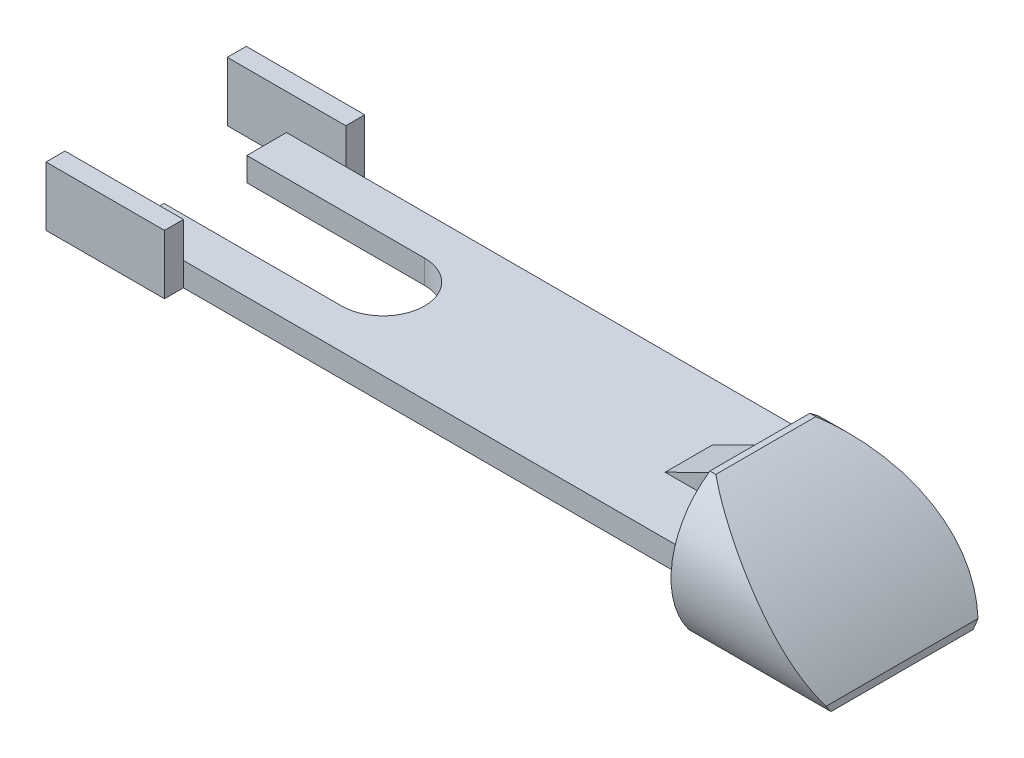
ISO-10303-21;
HEADER;
FILE_DESCRIPTION(('STEP AP214'),'2;1');
FILE_NAME('part.step','',(''),(''),'','','');
FILE_SCHEMA(('AUTOMOTIVE_DESIGN { 1 0 10303 214 1 1 1 1 }'));
ENDSEC;
DATA;
#1=APPLICATION_CONTEXT('core data for automotive mechanical design processes');
#2=APPLICATION_PROTOCOL_DEFINITION('international standard','automotive_design',2000,#1);
#3=PRODUCT_CONTEXT('',#1,'mechanical');
#4=PRODUCT('Part','Part','',(#3));
#5=PRODUCT_RELATED_PRODUCT_CATEGORY('part','',(#4));
#6=PRODUCT_DEFINITION_FORMATION('','',#4);
#7=PRODUCT_DEFINITION_CONTEXT('part definition',#1,'design');
#8=PRODUCT_DEFINITION('design','',#6,#7);
#9=PRODUCT_DEFINITION_SHAPE('','',#8);
#10=(LENGTH_UNIT() NAMED_UNIT(*) SI_UNIT(.MILLI.,.METRE.));
#11=(NAMED_UNIT(*) PLANE_ANGLE_UNIT() SI_UNIT($,.RADIAN.));
#12=(NAMED_UNIT(*) SI_UNIT($,.STERADIAN.) SOLID_ANGLE_UNIT());
#13=UNCERTAINTY_MEASURE_WITH_UNIT(LENGTH_MEASURE(1.E-05),#10,'distance_accuracy_value','');
#14=(GEOMETRIC_REPRESENTATION_CONTEXT(3) GLOBAL_UNCERTAINTY_ASSIGNED_CONTEXT((#13)) GLOBAL_UNIT_ASSIGNED_CONTEXT((#10,
#11,#12)) REPRESENTATION_CONTEXT('',''));
#15=CARTESIAN_POINT('',(0.,0.,0.));
#16=DIRECTION('',(0.,0.,1.));
#17=DIRECTION('',(1.,0.,0.));
#18=AXIS2_PLACEMENT_3D('',#15,#16,#17);
#19=CARTESIAN_POINT('',(44.958,0.,0.));
#20=DIRECTION('',(-1.,0.,0.));
#21=DIRECTION('',(0.,0.,1.));
#22=AXIS2_PLACEMENT_3D('',#19,#20,#21);
#23=CYLINDRICAL_SURFACE('',#22,9.525);
#24=CARTESIAN_POINT('',(30.353,7.87416386926256,5.35939999999999));
#25=CARTESIAN_POINT('',(30.4711552208598,7.81522187233303,5.44599264729982));
#26=CARTESIAN_POINT('',(30.5898798892083,7.75522676996046,5.53107482003074));
#27=CARTESIAN_POINT('',(30.8282833346403,7.63316206809079,5.69835031975136));
#28=CARTESIAN_POINT('',(30.9479620586325,7.57109258342401,5.78054380613325));
#29=CARTESIAN_POINT('',(31.3081137545909,7.38184070737959,6.02296434988924));
#30=CARTESIAN_POINT('',(31.5497596017097,7.2515863425635,6.17907326374504));
#31=CARTESIAN_POINT('',(32.035052577976,6.98304382480056,6.48101378156439));
#32=CARTESIAN_POINT('',(32.2787000895545,6.84475410448491,6.62684336809186));
#33=CARTESIAN_POINT('',(32.7671072292183,6.56024457576744,6.90861046324733));
#34=CARTESIAN_POINT('',(33.0118669282131,6.41402425504727,7.04454733147222));
#35=CARTESIAN_POINT('',(33.5038844626561,6.11242472503085,7.30782455778062));
#36=CARTESIAN_POINT('',(33.7511456250079,5.95697735276566,7.43508058436846));
#37=CARTESIAN_POINT('',(34.2454367178103,5.63812379760436,7.67968469048924));
#38=CARTESIAN_POINT('',(34.4924666482253,5.47471761348309,7.79703276849698));
#39=CARTESIAN_POINT('',(34.9857198829386,5.13999508929022,8.02163892790098));
#40=CARTESIAN_POINT('',(35.231943267834,4.96867956712086,8.12889804912457));
#41=CARTESIAN_POINT('',(35.7230717624413,4.61818344230006,8.3330142832771));
#42=CARTESIAN_POINT('',(35.9679769137035,4.43900308919437,8.42987172590863));
#43=CARTESIAN_POINT('',(36.615350195489,3.95324570615516,8.67248355487382));
#44=CARTESIAN_POINT('',(37.0162989728381,3.63986845194933,8.80887717605227));
#45=CARTESIAN_POINT('',(37.8109947303168,2.99226483565733,9.04937884428537));
#46=CARTESIAN_POINT('',(38.204741979873,2.65803925562915,9.15348810151049));
#47=CARTESIAN_POINT('',(38.9817314235425,1.97048899229939,9.3256684531131));
#48=CARTESIAN_POINT('',(39.3649964526994,1.61721180999234,9.39382498957951));
#49=CARTESIAN_POINT('',(40.1192189834872,0.892545402571446,9.49012636663356));
#50=CARTESIAN_POINT('',(40.4901807877642,0.521162623949694,9.5182853422699));
#51=CARTESIAN_POINT('',(41.1134674911044,-0.129236407722599,9.52798760632843));
#52=CARTESIAN_POINT('',(41.3695511386039,-0.404512685501206,9.52050315833296));
#53=CARTESIAN_POINT('',(41.872621249676,-0.961562076329113,9.48045312669297));
#54=CARTESIAN_POINT('',(42.1196078286631,-1.24333510688021,9.4478878613641));
#55=CARTESIAN_POINT('',(42.6023924587858,-1.81067447270711,9.3557162144324));
#56=CARTESIAN_POINT('',(42.838220151509,-2.09622784036543,9.2961864980631));
#57=CARTESIAN_POINT('',(43.2978288355468,-2.66934219726762,9.14810373597867));
#58=CARTESIAN_POINT('',(43.5216150411326,-2.95690225562146,9.05956337229982));
#59=CARTESIAN_POINT('',(43.9563582343193,-3.53202480143519,8.85122460766031));
#60=CARTESIAN_POINT('',(44.1672752997437,-3.81958477816423,8.73133448696689));
#61=CARTESIAN_POINT('',(44.4723906294046,-4.24764006501208,8.52691519942625));
#62=CARTESIAN_POINT('',(44.572334200622,-4.38994953330149,8.45457463085109));
#63=CARTESIAN_POINT('',(44.7682182598309,-4.67287740419351,8.30154866489254));
#64=CARTESIAN_POINT('',(44.8641578785885,-4.81349543492745,8.22086146859627));
#65=CARTESIAN_POINT('',(44.958,-4.95300000000001,8.13593362804783));
#66=B_SPLINE_CURVE_WITH_KNOTS('',3,(#24,#25,#26,#27,#28,#29,#30,#31,#32,#33,#34,#35,#36,#37,#38,
#39,#40,#41,#42,#43,#44,#45,#46,#47,#48,#49,#50,#51,#52,#53,#54,#55,#56,#57,#58,#59,#60,#61,#62,
#63,#64,#65),.UNSPECIFIED.,.F.,.F.,(4,2,2,2,2,2,2,2,2,2,2,2,2,2,2,2,2,2,2,2,4),(0.,
0.473678961686046,0.947331745505648,1.89440808672297,2.84166978798518,3.78899275559426,
4.74449280474611,5.69999300098531,6.6553946095911,7.61076592583453,9.1898664534919,
10.7689077818449,12.3441793971983,13.9188941764562,15.0461534334118,16.1733983838818,
17.2974582798821,18.421027446004,19.5479213421832,20.1127498946124,20.677700436759),.UNSPECIFIED.);
#67=CARTESIAN_POINT('',(30.353,7.87416386926255,5.35940000000001));
#68=VERTEX_POINT('',#67);
#69=CARTESIAN_POINT('',(44.958,-4.95300000000009,8.13593362804778));
#70=VERTEX_POINT('',#69);
#71=EDGE_CURVE('E240',#68,#70,#66,.T.);
#72=ORIENTED_EDGE('',*,*,#71,.F.);
#73=DIRECTION('',(-1.,0.,0.));
#74=VECTOR('',#73,1.);
#75=CARTESIAN_POINT('',(44.958,7.87416386926257,5.35939999999998));
#76=LINE('',#75,#74);
#77=CARTESIAN_POINT('',(29.718,7.87416386926257,5.35939999999999));
#78=VERTEX_POINT('',#77);
#79=EDGE_CURVE('E497',#68,#78,#76,.T.);
#80=ORIENTED_EDGE('',*,*,#79,.T.);
#81=CARTESIAN_POINT('',(29.718,0.,0.));
#82=DIRECTION('',(1.,0.,0.));
#83=DIRECTION('',(0.,0.,-1.));
#84=AXIS2_PLACEMENT_3D('',#81,#82,#83);
#85=CIRCLE('',#84,9.525);
#86=CARTESIAN_POINT('',(29.718,-5.715,7.61999999999999));
#87=VERTEX_POINT('',#86);
#88=EDGE_CURVE('E509',#78,#87,#85,.T.);
#89=ORIENTED_EDGE('',*,*,#88,.T.);
#90=DIRECTION('',(-1.,0.,0.));
#91=VECTOR('',#90,1.);
#92=CARTESIAN_POINT('',(44.958,-5.715,7.61999999999998));
#93=LINE('',#92,#91);
#94=CARTESIAN_POINT('',(44.958,-5.715,7.61999999999998));
#95=VERTEX_POINT('',#94);
#96=EDGE_CURVE('E489',#95,#87,#93,.T.);
#97=ORIENTED_EDGE('',*,*,#96,.F.);
#98=CARTESIAN_POINT('',(44.958,0.,0.));
#99=DIRECTION('',(1.,0.,0.));
#100=DIRECTION('',(0.,0.,-1.));
#101=AXIS2_PLACEMENT_3D('',#98,#99,#100);
#102=CIRCLE('',#101,9.525);
#103=EDGE_CURVE('E503',#70,#95,#102,.T.);
#104=ORIENTED_EDGE('',*,*,#103,.F.);
#105=EDGE_LOOP('',(#72,#80,#89,#97,#104));
#106=FACE_BOUND('',#105,.T.);
#107=ADVANCED_FACE('F33',(#106),#23,.T.);
#108=CARTESIAN_POINT('',(44.958,0.,0.));
#109=DIRECTION('',(-1.,0.,0.));
#110=DIRECTION('',(0.,0.,1.));
#111=AXIS2_PLACEMENT_3D('',#108,#109,#110);
#112=CYLINDRICAL_SURFACE('',#111,9.525);
#113=CARTESIAN_POINT('',(44.958,-4.95300000000007,-8.13593362804783));
#114=CARTESIAN_POINT('',(44.8555596623706,-4.80071180830957,-8.22864396710268));
#115=CARTESIAN_POINT('',(44.7506213958699,-4.64710154999901,-8.31629785648472));
#116=CARTESIAN_POINT('',(44.5359995481144,-4.33793147151329,-8.48166873489702));
#117=CARTESIAN_POINT('',(44.4263172955452,-4.18237220577169,-8.55938848244775));
#118=CARTESIAN_POINT('',(44.0909716225661,-3.71442206395958,-8.77763906699121));
#119=CARTESIAN_POINT('',(43.8585231287678,-3.40003313052581,-8.90369728820891));
#120=CARTESIAN_POINT('',(43.3809979874302,-2.77512849782377,-9.11767600711432));
#121=CARTESIAN_POINT('',(43.1361275463562,-2.46461621887944,-9.20607612590118));
#122=CARTESIAN_POINT('',(42.6327822404654,-1.84672505203001,-9.34964634656481));
#123=CARTESIAN_POINT('',(42.3742992446415,-1.53934817083445,-9.40479633707586));
#124=CARTESIAN_POINT('',(41.8043587462006,-0.883163740459351,-9.49060641921345));
#125=CARTESIAN_POINT('',(41.4909368353508,-0.535391364610888,-9.51609017153891));
#126=CARTESIAN_POINT('',(40.8511556036282,0.148647446096968,-9.52998367961493));
#127=CARTESIAN_POINT('',(40.5247959019053,0.484913541702039,-9.51839234318373));
#128=CARTESIAN_POINT('',(39.8595454315963,1.14559856659842,-9.46170074876956));
#129=CARTESIAN_POINT('',(39.5205945554169,1.46994031014419,-9.41641257112598));
#130=CARTESIAN_POINT('',(38.8339697671981,2.10327866377621,-9.29547151806993));
#131=CARTESIAN_POINT('',(38.4862952277635,2.41227416539087,-9.21981645280643));
#132=CARTESIAN_POINT('',(37.6622957777201,3.11829114589516,-9.01002780184462));
#133=CARTESIAN_POINT('',(37.1831377881974,3.50871303588465,-8.86471463529649));
#134=CARTESIAN_POINT('',(36.216242052247,4.25886692159246,-8.52974430159948));
#135=CARTESIAN_POINT('',(35.7285003833195,4.61858442263172,-8.34006634738238));
#136=CARTESIAN_POINT('',(34.7493883787148,5.30602806692687,-7.92045539239482));
#137=CARTESIAN_POINT('',(34.2580271123884,5.63381599129289,-7.69060263694967));
#138=CARTESIAN_POINT('',(33.5210737047148,6.10171296163223,-7.31672611913988));
#139=CARTESIAN_POINT('',(33.2754805456154,6.25368980280152,-7.18727639778348));
#140=CARTESIAN_POINT('',(32.7848980110315,6.54973011939466,-6.91857126540014));
#141=CARTESIAN_POINT('',(32.5399086056387,6.6937939946475,-6.77931635062613));
#142=CARTESIAN_POINT('',(31.9674074373105,7.02202454757821,-6.44125931039241));
#143=CARTESIAN_POINT('',(31.6404205617597,7.20299250596059,-6.23841876300196));
#144=CARTESIAN_POINT('',(31.1539373162074,7.46321866982138,-5.91985805214459));
#145=CARTESIAN_POINT('',(30.9926024999191,7.54801019161182,-5.81140394817164));
#146=CARTESIAN_POINT('',(30.6715076826171,7.71388815676973,-5.58933983396547));
#147=CARTESIAN_POINT('',(30.5117481409879,7.7949735430281,-5.4757283708792));
#148=CARTESIAN_POINT('',(30.353,7.87416386926255,-5.35940000000004));
#149=B_SPLINE_CURVE_WITH_KNOTS('',3,(#113,#114,#115,#116,#117,#118,#119,#120,#121,#122,#123,
#124,#125,#126,#127,#128,#129,#130,#131,#132,#133,#134,#135,#136,#137,#138,#139,#140,#141,#142,
#143,#144,#145,#146,#147,#148),.UNSPECIFIED.,.F.,.F.,(4,2,2,2,2,2,2,2,2,2,2,2,2,2,2,2,2,4),(0.,
0.616688686692369,1.23320575703192,2.46332612824306,3.67727365457095,4.89195470328431,
6.29652739308002,7.7011414600604,9.11364801163526,10.5262564417706,12.4283549176265,
14.3313464111344,16.230579415421,17.1798617397366,18.1290960541893,19.4039986980969,
20.0401730138625,20.6765276688526),.UNSPECIFIED.);
#150=CARTESIAN_POINT('',(44.958,-4.95300000000001,-8.13593362804776));
#151=VERTEX_POINT('',#150);
#152=CARTESIAN_POINT('',(30.353,7.87416386926255,-5.35939999999999));
#153=VERTEX_POINT('',#152);
#154=EDGE_CURVE('E232',#151,#153,#149,.T.);
#155=ORIENTED_EDGE('',*,*,#154,.F.);
#156=CARTESIAN_POINT('',(44.958,0.,0.));
#157=DIRECTION('',(1.,0.,0.));
#158=DIRECTION('',(0.,0.,-1.));
#159=AXIS2_PLACEMENT_3D('',#156,#157,#158);
#160=CIRCLE('',#159,9.525);
#161=CARTESIAN_POINT('',(44.958,-5.715,-7.62000000000002));
#162=VERTEX_POINT('',#161);
#163=EDGE_CURVE('E499',#162,#151,#160,.T.);
#164=ORIENTED_EDGE('',*,*,#163,.F.);
#165=DIRECTION('',(-1.,0.,0.));
#166=VECTOR('',#165,1.);
#167=CARTESIAN_POINT('',(44.958,-5.715,-7.62000000000002));
#168=LINE('',#167,#166);
#169=CARTESIAN_POINT('',(29.718,-5.715,-7.62000000000001));
#170=VERTEX_POINT('',#169);
#171=EDGE_CURVE('E492',#162,#170,#168,.T.);
#172=ORIENTED_EDGE('',*,*,#171,.T.);
#173=CARTESIAN_POINT('',(29.718,0.,0.));
#174=DIRECTION('',(1.,0.,0.));
#175=DIRECTION('',(0.,0.,-1.));
#176=AXIS2_PLACEMENT_3D('',#173,#174,#175);
#177=CIRCLE('',#176,9.525);
#178=CARTESIAN_POINT('',(29.718,7.87416386926257,-5.35940000000001));
#179=VERTEX_POINT('',#178);
#180=EDGE_CURVE('E504',#170,#179,#177,.T.);
#181=ORIENTED_EDGE('',*,*,#180,.T.);
#182=DIRECTION('',(-1.,0.,0.));
#183=VECTOR('',#182,1.);
#184=CARTESIAN_POINT('',(44.958,7.87416386926257,-5.35940000000002));
#185=LINE('',#184,#183);
#186=EDGE_CURVE('E495',#153,#179,#185,.T.);
#187=ORIENTED_EDGE('',*,*,#186,.F.);
#188=EDGE_LOOP('',(#155,#164,#172,#181,#187));
#189=FACE_BOUND('',#188,.T.);
#190=ADVANCED_FACE('F247',(#189),#112,.T.);
#191=CARTESIAN_POINT('',(44.958,7.87416386926257,5.35939999999998));
#192=DIRECTION('',(0.,-1.,0.));
#193=DIRECTION('',(0.,0.,-1.));
#194=AXIS2_PLACEMENT_3D('',#191,#192,#193);
#195=PLANE('',#194);
#196=DIRECTION('',(0.,0.,-1.));
#197=VECTOR('',#196,1.);
#198=CARTESIAN_POINT('',(30.353,7.87416386926255,117.01798658698));
#199=LINE('',#198,#197);
#200=EDGE_CURVE('E229',#68,#153,#199,.T.);
#201=ORIENTED_EDGE('',*,*,#200,.T.);
#202=ORIENTED_EDGE('',*,*,#186,.T.);
#203=DIRECTION('',(0.,0.,1.));
#204=VECTOR('',#203,1.);
#205=CARTESIAN_POINT('',(29.718,7.87416386926257,5.35939999999999));
#206=LINE('',#205,#204);
#207=EDGE_CURVE('E500',#179,#78,#206,.T.);
#208=ORIENTED_EDGE('',*,*,#207,.T.);
#209=ORIENTED_EDGE('',*,*,#79,.F.);
#210=EDGE_LOOP('',(#201,#202,#208,#209));
#211=FACE_BOUND('',#210,.T.);
#212=ADVANCED_FACE('F265',(#211),#195,.F.);
#213=CARTESIAN_POINT('',(44.958,0.,0.));
#214=DIRECTION('',(1.,0.,0.));
#215=DIRECTION('',(0.,0.,-1.));
#216=AXIS2_PLACEMENT_3D('',#213,#214,#215);
#217=PLANE('',#216);
#218=DIRECTION('',(0.,0.,-1.));
#219=VECTOR('',#218,1.);
#220=CARTESIAN_POINT('',(44.958,-5.715,7.61999999999998));
#221=LINE('',#220,#219);
#222=EDGE_CURVE('E514',#95,#162,#221,.T.);
#223=ORIENTED_EDGE('',*,*,#222,.T.);
#224=ORIENTED_EDGE('',*,*,#163,.T.);
#225=DIRECTION('',(0.,0.,-1.));
#226=VECTOR('',#225,1.);
#227=CARTESIAN_POINT('',(44.958,-4.95300000000009,117.01798658698));
#228=LINE('',#227,#226);
#229=EDGE_CURVE('E11',#151,#70,#228,.F.);
#230=ORIENTED_EDGE('',*,*,#229,.T.);
#231=ORIENTED_EDGE('',*,*,#103,.T.);
#232=EDGE_LOOP('',(#223,#224,#230,#231));
#233=FACE_BOUND('',#232,.T.);
#234=ADVANCED_FACE('F260',(#233),#217,.T.);
#235=CARTESIAN_POINT('',(-29.718,2.54,8.6995));
#236=DIRECTION('',(0.,0.,-1.));
#237=DIRECTION('',(-1.,0.,0.));
#238=AXIS2_PLACEMENT_3D('',#235,#236,#237);
#239=PLANE('',#238);
#240=DIRECTION('',(0.,1.,0.));
#241=VECTOR('',#240,1.);
#242=CARTESIAN_POINT('',(-23.368,0.,8.6995));
#243=LINE('',#242,#241);
#244=CARTESIAN_POINT('',(-23.368,0.,8.6995));
#245=VERTEX_POINT('',#244);
#246=CARTESIAN_POINT('',(-23.368,2.54,8.6995));
#247=VERTEX_POINT('',#246);
#248=EDGE_CURVE('E447',#245,#247,#243,.T.);
#249=ORIENTED_EDGE('',*,*,#248,.F.);
#250=DIRECTION('',(1.,0.,0.));
#251=VECTOR('',#250,1.);
#252=CARTESIAN_POINT('',(-29.718,0.,8.6995));
#253=LINE('',#252,#251);
#254=CARTESIAN_POINT('',(29.718,0.,8.6995));
#255=VERTEX_POINT('',#254);
#256=EDGE_CURVE('E206',#245,#255,#253,.T.);
#257=ORIENTED_EDGE('',*,*,#256,.T.);
#258=DIRECTION('',(0.,-1.,0.));
#259=VECTOR('',#258,1.);
#260=CARTESIAN_POINT('',(29.718,2.54,8.6995));
#261=LINE('',#260,#259);
#262=CARTESIAN_POINT('',(29.718,2.54,8.6995));
#263=VERTEX_POINT('',#262);
#264=EDGE_CURVE('E374',#263,#255,#261,.T.);
#265=ORIENTED_EDGE('',*,*,#264,.F.);
#266=DIRECTION('',(1.,0.,0.));
#267=VECTOR('',#266,1.);
#268=CARTESIAN_POINT('',(-29.718,2.54,8.6995));
#269=LINE('',#268,#267);
#270=EDGE_CURVE('E395',#247,#263,#269,.T.);
#271=ORIENTED_EDGE('',*,*,#270,.F.);
#272=EDGE_LOOP('',(#249,#257,#265,#271));
#273=FACE_BOUND('',#272,.T.);
#274=ADVANCED_FACE('F264',(#273),#239,.F.);
#275=CARTESIAN_POINT('',(-29.718,2.54,-8.6995));
#276=DIRECTION('',(1.,0.,0.));
#277=DIRECTION('',(0.,0.,-1.));
#278=AXIS2_PLACEMENT_3D('',#275,#276,#277);
#279=PLANE('',#278);
#280=DIRECTION('',(0.,0.,1.));
#281=VECTOR('',#280,1.);
#282=CARTESIAN_POINT('',(-29.718,0.,-8.6995));
#283=LINE('',#282,#281);
#284=CARTESIAN_POINT('',(-29.718,0.,-8.6995));
#285=VERTEX_POINT('',#284);
#286=CARTESIAN_POINT('',(-29.718,0.,-4.44499999999999));
#287=VERTEX_POINT('',#286);
#288=EDGE_CURVE('E359',#285,#287,#283,.T.);
#289=ORIENTED_EDGE('',*,*,#288,.T.);
#290=DIRECTION('',(0.,1.,0.));
#291=VECTOR('',#290,1.);
#292=CARTESIAN_POINT('',(-29.718,0.,-4.44499999999999));
#293=LINE('',#292,#291);
#294=CARTESIAN_POINT('',(-29.718,2.54,-4.44499999999999));
#295=VERTEX_POINT('',#294);
#296=EDGE_CURVE('E361',#287,#295,#293,.T.);
#297=ORIENTED_EDGE('',*,*,#296,.T.);
#298=DIRECTION('',(0.,0.,1.));
#299=VECTOR('',#298,1.);
#300=CARTESIAN_POINT('',(-29.718,2.54,-8.6995));
#301=LINE('',#300,#299);
#302=CARTESIAN_POINT('',(-29.718,2.54,-8.6995));
#303=VERTEX_POINT('',#302);
#304=EDGE_CURVE('E391',#303,#295,#301,.T.);
#305=ORIENTED_EDGE('',*,*,#304,.F.);
#306=DIRECTION('',(0.,-1.,0.));
#307=VECTOR('',#306,1.);
#308=CARTESIAN_POINT('',(-29.718,2.54,-8.6995));
#309=LINE('',#308,#307);
#310=EDGE_CURVE('E363',#303,#285,#309,.T.);
#311=ORIENTED_EDGE('',*,*,#310,.T.);
#312=EDGE_LOOP('',(#289,#297,#305,#311));
#313=FACE_BOUND('',#312,.T.);
#314=ADVANCED_FACE('F342',(#313),#279,.F.);
#315=CARTESIAN_POINT('',(-29.718,2.54,-8.6995));
#316=DIRECTION('',(0.,0.,1.));
#317=DIRECTION('',(1.,0.,0.));
#318=AXIS2_PLACEMENT_3D('',#315,#316,#317);
#319=PLANE('',#318);
#320=DIRECTION('',(-1.,0.,0.));
#321=VECTOR('',#320,1.);
#322=CARTESIAN_POINT('',(-29.718,0.,-8.6995));
#323=LINE('',#322,#321);
#324=CARTESIAN_POINT('',(29.718,0.,-8.6995));
#325=VERTEX_POINT('',#324);
#326=CARTESIAN_POINT('',(-23.368,0.,-8.6995));
#327=VERTEX_POINT('',#326);
#328=EDGE_CURVE('E370',#325,#327,#323,.T.);
#329=ORIENTED_EDGE('',*,*,#328,.T.);
#330=DIRECTION('',(0.,1.,0.));
#331=VECTOR('',#330,1.);
#332=CARTESIAN_POINT('',(-23.368,0.,-8.6995));
#333=LINE('',#332,#331);
#334=CARTESIAN_POINT('',(-23.368,2.54,-8.6995));
#335=VERTEX_POINT('',#334);
#336=EDGE_CURVE('E386',#327,#335,#333,.T.);
#337=ORIENTED_EDGE('',*,*,#336,.T.);
#338=DIRECTION('',(-1.,0.,0.));
#339=VECTOR('',#338,1.);
#340=CARTESIAN_POINT('',(-29.718,2.54,-8.6995));
#341=LINE('',#340,#339);
#342=CARTESIAN_POINT('',(29.718,2.54,-8.6995));
#343=VERTEX_POINT('',#342);
#344=EDGE_CURVE('E384',#343,#335,#341,.T.);
#345=ORIENTED_EDGE('',*,*,#344,.F.);
#346=DIRECTION('',(0.,-1.,0.));
#347=VECTOR('',#346,1.);
#348=CARTESIAN_POINT('',(29.718,2.54,-8.6995));
#349=LINE('',#348,#347);
#350=EDGE_CURVE('E41',#343,#325,#349,.T.);
#351=ORIENTED_EDGE('',*,*,#350,.T.);
#352=EDGE_LOOP('',(#329,#337,#345,#351));
#353=FACE_BOUND('',#352,.T.);
#354=ADVANCED_FACE('F35',(#353),#319,.F.);
#355=CARTESIAN_POINT('',(-29.718,2.54,4.44500000000001));
#356=VERTEX_POINT('',#355);
#357=CARTESIAN_POINT('',(-29.718,2.54,8.6995));
#358=VERTEX_POINT('',#357);
#359=EDGE_CURVE('E388',#356,#358,#301,.T.);
#360=ORIENTED_EDGE('',*,*,#359,.F.);
#361=DIRECTION('',(0.,1.,0.));
#362=VECTOR('',#361,1.);
#363=CARTESIAN_POINT('',(-29.718,0.,4.44500000000001));
#364=LINE('',#363,#362);
#365=CARTESIAN_POINT('',(-29.718,0.,4.44500000000001));
#366=VERTEX_POINT('',#365);
#367=EDGE_CURVE('E405',#366,#356,#364,.T.);
#368=ORIENTED_EDGE('',*,*,#367,.F.);
#369=CARTESIAN_POINT('',(-29.718,0.,8.6995));
#370=VERTEX_POINT('',#369);
#371=EDGE_CURVE('E366',#366,#370,#283,.T.);
#372=ORIENTED_EDGE('',*,*,#371,.T.);
#373=DIRECTION('',(0.,-1.,0.));
#374=VECTOR('',#373,1.);
#375=CARTESIAN_POINT('',(-29.718,2.54,8.6995));
#376=LINE('',#375,#374);
#377=EDGE_CURVE('E377',#358,#370,#376,.T.);
#378=ORIENTED_EDGE('',*,*,#377,.F.);
#379=EDGE_LOOP('',(#360,#368,#372,#378));
#380=FACE_BOUND('',#379,.T.);
#381=ADVANCED_FACE('F337',(#380),#279,.F.);
#382=CARTESIAN_POINT('',(0.,2.54,0.));
#383=DIRECTION('',(0.,1.,0.));
#384=DIRECTION('',(0.,0.,1.));
#385=AXIS2_PLACEMENT_3D('',#382,#383,#384);
#386=PLANE('',#385);
#387=DIRECTION('',(0.,0.,-1.));
#388=VECTOR('',#387,1.);
#389=CARTESIAN_POINT('',(29.718,2.54,-8.6995));
#390=LINE('',#389,#388);
#391=CARTESIAN_POINT('',(29.718,2.54,2.54));
#392=VERTEX_POINT('',#391);
#393=EDGE_CURVE('E205',#263,#392,#390,.T.);
#394=ORIENTED_EDGE('',*,*,#393,.T.);
#395=DIRECTION('',(1.,0.,0.));
#396=VECTOR('',#395,1.);
#397=CARTESIAN_POINT('',(0.,2.54,2.54));
#398=LINE('',#397,#396);
#399=CARTESIAN_POINT('',(22.098,2.54,2.54));
#400=VERTEX_POINT('',#399);
#401=EDGE_CURVE('E48',#400,#392,#398,.T.);
#402=ORIENTED_EDGE('',*,*,#401,.F.);
#403=DIRECTION('',(0.,0.,-1.));
#404=VECTOR('',#403,1.);
#405=CARTESIAN_POINT('',(22.098,2.54,0.));
#406=LINE('',#405,#404);
#407=CARTESIAN_POINT('',(22.098,2.54,-2.54));
#408=VERTEX_POINT('',#407);
#409=EDGE_CURVE('E52',#408,#400,#406,.F.);
#410=ORIENTED_EDGE('',*,*,#409,.F.);
#411=DIRECTION('',(1.,0.,0.));
#412=VECTOR('',#411,1.);
#413=CARTESIAN_POINT('',(0.,2.54,-2.54));
#414=LINE('',#413,#412);
#415=CARTESIAN_POINT('',(29.718,2.54,-2.54));
#416=VERTEX_POINT('',#415);
#417=EDGE_CURVE('E208',#408,#416,#414,.T.);
#418=ORIENTED_EDGE('',*,*,#417,.T.);
#419=EDGE_CURVE('E197',#416,#343,#390,.T.);
#420=ORIENTED_EDGE('',*,*,#419,.T.);
#421=ORIENTED_EDGE('',*,*,#344,.T.);
#422=EDGE_CURVE('E389',#335,#303,#341,.T.);
#423=ORIENTED_EDGE('',*,*,#422,.T.);
#424=ORIENTED_EDGE('',*,*,#304,.T.);
#425=DIRECTION('',(-1.,0.,0.));
#426=VECTOR('',#425,1.);
#427=CARTESIAN_POINT('',(-29.718,2.54,-4.44499999999999));
#428=LINE('',#427,#426);
#429=CARTESIAN_POINT('',(-10.668,2.54,-4.44499999999999));
#430=VERTEX_POINT('',#429);
#431=EDGE_CURVE('E402',#430,#295,#428,.T.);
#432=ORIENTED_EDGE('',*,*,#431,.F.);
#433=CARTESIAN_POINT('',(-10.668,2.54,0.));
#434=DIRECTION('',(0.,1.,0.));
#435=DIRECTION('',(0.,0.,-1.));
#436=AXIS2_PLACEMENT_3D('',#433,#434,#435);
#437=CIRCLE('',#436,4.445);
#438=CARTESIAN_POINT('',(-10.668,2.54,4.44500000000001));
#439=VERTEX_POINT('',#438);
#440=EDGE_CURVE('E419',#439,#430,#437,.T.);
#441=ORIENTED_EDGE('',*,*,#440,.F.);
#442=DIRECTION('',(1.,0.,0.));
#443=VECTOR('',#442,1.);
#444=CARTESIAN_POINT('',(-29.718,2.54,4.44500000000001));
#445=LINE('',#444,#443);
#446=EDGE_CURVE('E418',#356,#439,#445,.T.);
#447=ORIENTED_EDGE('',*,*,#446,.F.);
#448=ORIENTED_EDGE('',*,*,#359,.T.);
#449=EDGE_CURVE('E378',#358,#247,#269,.T.);
#450=ORIENTED_EDGE('',*,*,#449,.T.);
#451=ORIENTED_EDGE('',*,*,#270,.T.);
#452=EDGE_LOOP('',(#394,#402,#410,#418,#420,#421,#423,#424,#432,#441,#447,#448,#450,#451));
#453=FACE_BOUND('',#452,.T.);
#454=ADVANCED_FACE('F209',(#453),#386,.T.);
#455=CARTESIAN_POINT('',(0.,0.,0.));
#456=DIRECTION('',(0.,1.,0.));
#457=DIRECTION('',(0.,0.,1.));
#458=AXIS2_PLACEMENT_3D('',#455,#456,#457);
#459=PLANE('',#458);
#460=ORIENTED_EDGE('',*,*,#328,.F.);
#461=DIRECTION('',(0.,0.,-1.));
#462=VECTOR('',#461,1.);
#463=CARTESIAN_POINT('',(29.718,0.,-8.6995));
#464=LINE('',#463,#462);
#465=EDGE_CURVE('E396',#255,#325,#464,.T.);
#466=ORIENTED_EDGE('',*,*,#465,.F.);
#467=ORIENTED_EDGE('',*,*,#256,.F.);
#468=DIRECTION('',(0.,0.,-1.));
#469=VECTOR('',#468,1.);
#470=CARTESIAN_POINT('',(-23.368,0.,10.7315));
#471=LINE('',#470,#469);
#472=CARTESIAN_POINT('',(-23.368,0.,10.7315));
#473=VERTEX_POINT('',#472);
#474=EDGE_CURVE('E435',#473,#245,#471,.T.);
#475=ORIENTED_EDGE('',*,*,#474,.F.);
#476=DIRECTION('',(1.,0.,0.));
#477=VECTOR('',#476,1.);
#478=CARTESIAN_POINT('',(-23.368,0.,10.7315));
#479=LINE('',#478,#477);
#480=CARTESIAN_POINT('',(-36.068,0.,10.7315));
#481=VERTEX_POINT('',#480);
#482=EDGE_CURVE('E438',#481,#473,#479,.T.);
#483=ORIENTED_EDGE('',*,*,#482,.F.);
#484=DIRECTION('',(0.,0.,-1.));
#485=VECTOR('',#484,1.);
#486=CARTESIAN_POINT('',(-36.068,0.,10.7315));
#487=LINE('',#486,#485);
#488=CARTESIAN_POINT('',(-36.068,0.,8.6995));
#489=VERTEX_POINT('',#488);
#490=EDGE_CURVE('E432',#481,#489,#487,.T.);
#491=ORIENTED_EDGE('',*,*,#490,.T.);
#492=DIRECTION('',(1.,0.,0.));
#493=VECTOR('',#492,1.);
#494=CARTESIAN_POINT('',(-23.368,0.,8.6995));
#495=LINE('',#494,#493);
#496=EDGE_CURVE('E439',#489,#370,#495,.T.);
#497=ORIENTED_EDGE('',*,*,#496,.T.);
#498=ORIENTED_EDGE('',*,*,#371,.F.);
#499=DIRECTION('',(1.,0.,0.));
#500=VECTOR('',#499,1.);
#501=CARTESIAN_POINT('',(-29.718,0.,4.44500000000001));
#502=LINE('',#501,#500);
#503=CARTESIAN_POINT('',(-10.668,0.,4.44500000000001));
#504=VERTEX_POINT('',#503);
#505=EDGE_CURVE('E414',#366,#504,#502,.T.);
#506=ORIENTED_EDGE('',*,*,#505,.T.);
#507=CARTESIAN_POINT('',(-10.668,0.,0.));
#508=DIRECTION('',(0.,1.,0.));
#509=DIRECTION('',(0.,0.,-1.));
#510=AXIS2_PLACEMENT_3D('',#507,#508,#509);
#511=CIRCLE('',#510,4.445);
#512=CARTESIAN_POINT('',(-10.668,0.,-4.44499999999999));
#513=VERTEX_POINT('',#512);
#514=EDGE_CURVE('E410',#504,#513,#511,.T.);
#515=ORIENTED_EDGE('',*,*,#514,.T.);
#516=DIRECTION('',(-1.,0.,0.));
#517=VECTOR('',#516,1.);
#518=CARTESIAN_POINT('',(-29.718,0.,-4.44499999999999));
#519=LINE('',#518,#517);
#520=EDGE_CURVE('E406',#513,#287,#519,.T.);
#521=ORIENTED_EDGE('',*,*,#520,.T.);
#522=ORIENTED_EDGE('',*,*,#288,.F.);
#523=DIRECTION('',(1.,0.,0.));
#524=VECTOR('',#523,1.);
#525=CARTESIAN_POINT('',(-23.368,0.,-8.6995));
#526=LINE('',#525,#524);
#527=CARTESIAN_POINT('',(-36.068,0.,-8.6995));
#528=VERTEX_POINT('',#527);
#529=EDGE_CURVE('E475',#528,#285,#526,.T.);
#530=ORIENTED_EDGE('',*,*,#529,.F.);
#531=DIRECTION('',(0.,0.,1.));
#532=VECTOR('',#531,1.);
#533=CARTESIAN_POINT('',(-36.068,0.,-10.7315));
#534=LINE('',#533,#532);
#535=CARTESIAN_POINT('',(-36.068,0.,-10.7315));
#536=VERTEX_POINT('',#535);
#537=EDGE_CURVE('E460',#536,#528,#534,.T.);
#538=ORIENTED_EDGE('',*,*,#537,.F.);
#539=DIRECTION('',(1.,0.,0.));
#540=VECTOR('',#539,1.);
#541=CARTESIAN_POINT('',(-23.368,0.,-10.7315));
#542=LINE('',#541,#540);
#543=CARTESIAN_POINT('',(-23.368,0.,-10.7315));
#544=VERTEX_POINT('',#543);
#545=EDGE_CURVE('E484',#536,#544,#542,.T.);
#546=ORIENTED_EDGE('',*,*,#545,.T.);
#547=DIRECTION('',(0.,0.,1.));
#548=VECTOR('',#547,1.);
#549=CARTESIAN_POINT('',(-23.368,0.,-10.7315));
#550=LINE('',#549,#548);
#551=EDGE_CURVE('E458',#544,#327,#550,.T.);
#552=ORIENTED_EDGE('',*,*,#551,.T.);
#553=EDGE_LOOP('',(#460,#466,#467,#475,#483,#491,#497,#498,#506,#515,#521,#522,#530,#538,#546,#552));
#554=FACE_BOUND('',#553,.T.);
#555=ADVANCED_FACE('F327',(#554),#459,.F.);
#556=CARTESIAN_POINT('',(-29.718,0.,-4.44499999999999));
#557=DIRECTION('',(0.,0.,-1.));
#558=DIRECTION('',(-1.,0.,0.));
#559=AXIS2_PLACEMENT_3D('',#556,#557,#558);
#560=PLANE('',#559);
#561=ORIENTED_EDGE('',*,*,#431,.T.);
#562=ORIENTED_EDGE('',*,*,#296,.F.);
#563=ORIENTED_EDGE('',*,*,#520,.F.);
#564=DIRECTION('',(0.,1.,0.));
#565=VECTOR('',#564,1.);
#566=CARTESIAN_POINT('',(-10.668,0.,-4.44499999999999));
#567=LINE('',#566,#565);
#568=EDGE_CURVE('E397',#513,#430,#567,.T.);
#569=ORIENTED_EDGE('',*,*,#568,.T.);
#570=EDGE_LOOP('',(#561,#562,#563,#569));
#571=FACE_BOUND('',#570,.T.);
#572=ADVANCED_FACE('F323',(#571),#560,.F.);
#573=CARTESIAN_POINT('',(-10.668,0.,0.));
#574=DIRECTION('',(0.,1.,0.));
#575=DIRECTION('',(0.,0.,1.));
#576=AXIS2_PLACEMENT_3D('',#573,#574,#575);
#577=CYLINDRICAL_SURFACE('',#576,4.445);
#578=ORIENTED_EDGE('',*,*,#440,.T.);
#579=ORIENTED_EDGE('',*,*,#568,.F.);
#580=ORIENTED_EDGE('',*,*,#514,.F.);
#581=DIRECTION('',(0.,1.,0.));
#582=VECTOR('',#581,1.);
#583=CARTESIAN_POINT('',(-10.668,0.,4.44500000000001));
#584=LINE('',#583,#582);
#585=EDGE_CURVE('E399',#504,#439,#584,.T.);
#586=ORIENTED_EDGE('',*,*,#585,.T.);
#587=EDGE_LOOP('',(#578,#579,#580,#586));
#588=FACE_BOUND('',#587,.T.);
#589=ADVANCED_FACE('F326',(#588),#577,.F.);
#590=CARTESIAN_POINT('',(-29.718,0.,4.44500000000001));
#591=DIRECTION('',(0.,0.,1.));
#592=DIRECTION('',(1.,0.,0.));
#593=AXIS2_PLACEMENT_3D('',#590,#591,#592);
#594=PLANE('',#593);
#595=ORIENTED_EDGE('',*,*,#446,.T.);
#596=ORIENTED_EDGE('',*,*,#585,.F.);
#597=ORIENTED_EDGE('',*,*,#505,.F.);
#598=ORIENTED_EDGE('',*,*,#367,.T.);
#599=EDGE_LOOP('',(#595,#596,#597,#598));
#600=FACE_BOUND('',#599,.T.);
#601=ADVANCED_FACE('F321',(#600),#594,.F.);
#602=CARTESIAN_POINT('',(-23.368,0.,10.7315));
#603=DIRECTION('',(-1.,0.,0.));
#604=DIRECTION('',(0.,0.,1.));
#605=AXIS2_PLACEMENT_3D('',#602,#603,#604);
#606=PLANE('',#605);
#607=ORIENTED_EDGE('',*,*,#248,.T.);
#608=CARTESIAN_POINT('',(-23.368,6.35,8.6995));
#609=VERTEX_POINT('',#608);
#610=EDGE_CURVE('E450',#247,#609,#243,.T.);
#611=ORIENTED_EDGE('',*,*,#610,.T.);
#612=DIRECTION('',(0.,0.,-1.));
#613=VECTOR('',#612,1.);
#614=CARTESIAN_POINT('',(-23.368,6.35,10.7315));
#615=LINE('',#614,#613);
#616=CARTESIAN_POINT('',(-23.368,6.35,10.7315));
#617=VERTEX_POINT('',#616);
#618=EDGE_CURVE('E420',#617,#609,#615,.T.);
#619=ORIENTED_EDGE('',*,*,#618,.F.);
#620=DIRECTION('',(0.,1.,0.));
#621=VECTOR('',#620,1.);
#622=CARTESIAN_POINT('',(-23.368,0.,10.7315));
#623=LINE('',#622,#621);
#624=EDGE_CURVE('E442',#473,#617,#623,.T.);
#625=ORIENTED_EDGE('',*,*,#624,.F.);
#626=ORIENTED_EDGE('',*,*,#474,.T.);
#627=EDGE_LOOP('',(#607,#611,#619,#625,#626));
#628=FACE_BOUND('',#627,.T.);
#629=ADVANCED_FACE('F317',(#628),#606,.F.);
#630=CARTESIAN_POINT('',(-23.368,6.35,10.7315));
#631=DIRECTION('',(0.,-1.,0.));
#632=DIRECTION('',(1.,0.,0.));
#633=AXIS2_PLACEMENT_3D('',#630,#631,#632);
#634=PLANE('',#633);
#635=DIRECTION('',(-1.,0.,0.));
#636=VECTOR('',#635,1.);
#637=CARTESIAN_POINT('',(-23.368,6.35,8.6995));
#638=LINE('',#637,#636);
#639=CARTESIAN_POINT('',(-36.068,6.35,8.6995));
#640=VERTEX_POINT('',#639);
#641=EDGE_CURVE('E445',#609,#640,#638,.T.);
#642=ORIENTED_EDGE('',*,*,#641,.T.);
#643=DIRECTION('',(0.,0.,-1.));
#644=VECTOR('',#643,1.);
#645=CARTESIAN_POINT('',(-36.068,6.35,10.7315));
#646=LINE('',#645,#644);
#647=CARTESIAN_POINT('',(-36.068,6.35,10.7315));
#648=VERTEX_POINT('',#647);
#649=EDGE_CURVE('E429',#648,#640,#646,.T.);
#650=ORIENTED_EDGE('',*,*,#649,.F.);
#651=DIRECTION('',(-1.,0.,0.));
#652=VECTOR('',#651,1.);
#653=CARTESIAN_POINT('',(-23.368,6.35,10.7315));
#654=LINE('',#653,#652);
#655=EDGE_CURVE('E454',#617,#648,#654,.T.);
#656=ORIENTED_EDGE('',*,*,#655,.F.);
#657=ORIENTED_EDGE('',*,*,#618,.T.);
#658=EDGE_LOOP('',(#642,#650,#656,#657));
#659=FACE_BOUND('',#658,.T.);
#660=ADVANCED_FACE('F313',(#659),#634,.F.);
#661=CARTESIAN_POINT('',(-36.068,0.,10.7315));
#662=DIRECTION('',(1.,0.,0.));
#663=DIRECTION('',(0.,0.,-1.));
#664=AXIS2_PLACEMENT_3D('',#661,#662,#663);
#665=PLANE('',#664);
#666=DIRECTION('',(0.,-1.,0.));
#667=VECTOR('',#666,1.);
#668=CARTESIAN_POINT('',(-36.068,0.,8.6995));
#669=LINE('',#668,#667);
#670=EDGE_CURVE('E443',#640,#489,#669,.T.);
#671=ORIENTED_EDGE('',*,*,#670,.T.);
#672=ORIENTED_EDGE('',*,*,#490,.F.);
#673=DIRECTION('',(0.,-1.,0.));
#674=VECTOR('',#673,1.);
#675=CARTESIAN_POINT('',(-36.068,0.,10.7315));
#676=LINE('',#675,#674);
#677=EDGE_CURVE('E452',#648,#481,#676,.T.);
#678=ORIENTED_EDGE('',*,*,#677,.F.);
#679=ORIENTED_EDGE('',*,*,#649,.T.);
#680=EDGE_LOOP('',(#671,#672,#678,#679));
#681=FACE_BOUND('',#680,.T.);
#682=ADVANCED_FACE('F306',(#681),#665,.F.);
#683=CARTESIAN_POINT('',(0.,0.,10.7315));
#684=DIRECTION('',(0.,0.,1.));
#685=DIRECTION('',(1.,0.,0.));
#686=AXIS2_PLACEMENT_3D('',#683,#684,#685);
#687=PLANE('',#686);
#688=ORIENTED_EDGE('',*,*,#624,.T.);
#689=ORIENTED_EDGE('',*,*,#655,.T.);
#690=ORIENTED_EDGE('',*,*,#677,.T.);
#691=ORIENTED_EDGE('',*,*,#482,.T.);
#692=EDGE_LOOP('',(#688,#689,#690,#691));
#693=FACE_BOUND('',#692,.T.);
#694=ADVANCED_FACE('F303',(#693),#687,.T.);
#695=CARTESIAN_POINT('',(0.,0.,8.6995));
#696=DIRECTION('',(0.,0.,1.));
#697=DIRECTION('',(1.,0.,0.));
#698=AXIS2_PLACEMENT_3D('',#695,#696,#697);
#699=PLANE('',#698);
#700=ORIENTED_EDGE('',*,*,#449,.F.);
#701=ORIENTED_EDGE('',*,*,#377,.T.);
#702=ORIENTED_EDGE('',*,*,#496,.F.);
#703=ORIENTED_EDGE('',*,*,#670,.F.);
#704=ORIENTED_EDGE('',*,*,#641,.F.);
#705=ORIENTED_EDGE('',*,*,#610,.F.);
#706=EDGE_LOOP('',(#700,#701,#702,#703,#704,#705));
#707=FACE_BOUND('',#706,.T.);
#708=ADVANCED_FACE('F301',(#707),#699,.F.);
#709=CARTESIAN_POINT('',(-23.368,0.,-10.7315));
#710=DIRECTION('',(1.,0.,0.));
#711=DIRECTION('',(0.,0.,-1.));
#712=AXIS2_PLACEMENT_3D('',#709,#710,#711);
#713=PLANE('',#712);
#714=ORIENTED_EDGE('',*,*,#336,.F.);
#715=ORIENTED_EDGE('',*,*,#551,.F.);
#716=DIRECTION('',(0.,1.,0.));
#717=VECTOR('',#716,1.);
#718=CARTESIAN_POINT('',(-23.368,0.,-10.7315));
#719=LINE('',#718,#717);
#720=CARTESIAN_POINT('',(-23.368,6.35,-10.7315));
#721=VERTEX_POINT('',#720);
#722=EDGE_CURVE('E471',#544,#721,#719,.T.);
#723=ORIENTED_EDGE('',*,*,#722,.T.);
#724=DIRECTION('',(0.,0.,1.));
#725=VECTOR('',#724,1.);
#726=CARTESIAN_POINT('',(-23.368,6.35,-10.7315));
#727=LINE('',#726,#725);
#728=CARTESIAN_POINT('',(-23.368,6.35,-8.6995));
#729=VERTEX_POINT('',#728);
#730=EDGE_CURVE('E464',#721,#729,#727,.T.);
#731=ORIENTED_EDGE('',*,*,#730,.T.);
#732=EDGE_CURVE('E478',#335,#729,#333,.T.);
#733=ORIENTED_EDGE('',*,*,#732,.F.);
#734=EDGE_LOOP('',(#714,#715,#723,#731,#733));
#735=FACE_BOUND('',#734,.T.);
#736=ADVANCED_FACE('F297',(#735),#713,.T.);
#737=CARTESIAN_POINT('',(-36.068,0.,-10.7315));
#738=DIRECTION('',(-1.,0.,0.));
#739=DIRECTION('',(0.,0.,1.));
#740=AXIS2_PLACEMENT_3D('',#737,#738,#739);
#741=PLANE('',#740);
#742=DIRECTION('',(0.,-1.,0.));
#743=VECTOR('',#742,1.);
#744=CARTESIAN_POINT('',(-36.068,0.,-8.6995));
#745=LINE('',#744,#743);
#746=CARTESIAN_POINT('',(-36.068,6.35,-8.6995));
#747=VERTEX_POINT('',#746);
#748=EDGE_CURVE('E472',#747,#528,#745,.T.);
#749=ORIENTED_EDGE('',*,*,#748,.F.);
#750=DIRECTION('',(0.,0.,1.));
#751=VECTOR('',#750,1.);
#752=CARTESIAN_POINT('',(-36.068,6.35,-10.7315));
#753=LINE('',#752,#751);
#754=CARTESIAN_POINT('',(-36.068,6.35,-10.7315));
#755=VERTEX_POINT('',#754);
#756=EDGE_CURVE('E462',#755,#747,#753,.T.);
#757=ORIENTED_EDGE('',*,*,#756,.F.);
#758=DIRECTION('',(0.,-1.,0.));
#759=VECTOR('',#758,1.);
#760=CARTESIAN_POINT('',(-36.068,0.,-10.7315));
#761=LINE('',#760,#759);
#762=EDGE_CURVE('E481',#755,#536,#761,.T.);
#763=ORIENTED_EDGE('',*,*,#762,.T.);
#764=ORIENTED_EDGE('',*,*,#537,.T.);
#765=EDGE_LOOP('',(#749,#757,#763,#764));
#766=FACE_BOUND('',#765,.T.);
#767=ADVANCED_FACE('F293',(#766),#741,.T.);
#768=CARTESIAN_POINT('',(-23.368,6.35,-10.7315));
#769=DIRECTION('',(0.,1.,0.));
#770=DIRECTION('',(-1.,0.,0.));
#771=AXIS2_PLACEMENT_3D('',#768,#769,#770);
#772=PLANE('',#771);
#773=DIRECTION('',(-1.,0.,0.));
#774=VECTOR('',#773,1.);
#775=CARTESIAN_POINT('',(-23.368,6.35,-8.6995));
#776=LINE('',#775,#774);
#777=EDGE_CURVE('E468',#729,#747,#776,.T.);
#778=ORIENTED_EDGE('',*,*,#777,.F.);
#779=ORIENTED_EDGE('',*,*,#730,.F.);
#780=DIRECTION('',(-1.,0.,0.));
#781=VECTOR('',#780,1.);
#782=CARTESIAN_POINT('',(-23.368,6.35,-10.7315));
#783=LINE('',#782,#781);
#784=EDGE_CURVE('E467',#721,#755,#783,.T.);
#785=ORIENTED_EDGE('',*,*,#784,.T.);
#786=ORIENTED_EDGE('',*,*,#756,.T.);
#787=EDGE_LOOP('',(#778,#779,#785,#786));
#788=FACE_BOUND('',#787,.T.);
#789=ADVANCED_FACE('F286',(#788),#772,.T.);
#790=CARTESIAN_POINT('',(0.,0.,-10.7315));
#791=DIRECTION('',(0.,0.,-1.));
#792=DIRECTION('',(1.,0.,0.));
#793=AXIS2_PLACEMENT_3D('',#790,#791,#792);
#794=PLANE('',#793);
#795=ORIENTED_EDGE('',*,*,#722,.F.);
#796=ORIENTED_EDGE('',*,*,#545,.F.);
#797=ORIENTED_EDGE('',*,*,#762,.F.);
#798=ORIENTED_EDGE('',*,*,#784,.F.);
#799=EDGE_LOOP('',(#795,#796,#797,#798));
#800=FACE_BOUND('',#799,.T.);
#801=ADVANCED_FACE('F283',(#800),#794,.T.);
#802=CARTESIAN_POINT('',(0.,0.,-8.6995));
#803=DIRECTION('',(0.,0.,-1.));
#804=DIRECTION('',(1.,0.,0.));
#805=AXIS2_PLACEMENT_3D('',#802,#803,#804);
#806=PLANE('',#805);
#807=ORIENTED_EDGE('',*,*,#310,.F.);
#808=ORIENTED_EDGE('',*,*,#422,.F.);
#809=ORIENTED_EDGE('',*,*,#732,.T.);
#810=ORIENTED_EDGE('',*,*,#777,.T.);
#811=ORIENTED_EDGE('',*,*,#748,.T.);
#812=ORIENTED_EDGE('',*,*,#529,.T.);
#813=EDGE_LOOP('',(#807,#808,#809,#810,#811,#812));
#814=FACE_BOUND('',#813,.T.);
#815=ADVANCED_FACE('F268',(#814),#806,.F.);
#816=CARTESIAN_POINT('',(29.718,0.,0.));
#817=DIRECTION('',(1.,0.,0.));
#818=DIRECTION('',(0.,0.,-1.));
#819=AXIS2_PLACEMENT_3D('',#816,#817,#818);
#820=PLANE('',#819);
#821=ORIENTED_EDGE('',*,*,#180,.F.);
#822=DIRECTION('',(0.,0.,-1.));
#823=VECTOR('',#822,1.);
#824=CARTESIAN_POINT('',(29.718,-5.715,7.61999999999999));
#825=LINE('',#824,#823);
#826=EDGE_CURVE('E507',#87,#170,#825,.T.);
#827=ORIENTED_EDGE('',*,*,#826,.F.);
#828=ORIENTED_EDGE('',*,*,#88,.F.);
#829=ORIENTED_EDGE('',*,*,#207,.F.);
#830=EDGE_LOOP('',(#821,#827,#828,#829));
#831=FACE_BOUND('',#830,.T.);
#832=ORIENTED_EDGE('',*,*,#465,.T.);
#833=ORIENTED_EDGE('',*,*,#350,.F.);
#834=ORIENTED_EDGE('',*,*,#419,.F.);
#835=DIRECTION('',(0.,-1.,0.));
#836=VECTOR('',#835,1.);
#837=CARTESIAN_POINT('',(29.718,0.,-2.54));
#838=LINE('',#837,#836);
#839=CARTESIAN_POINT('',(29.718,6.3266450850324,-2.54));
#840=VERTEX_POINT('',#839);
#841=EDGE_CURVE('E200',#840,#416,#838,.T.);
#842=ORIENTED_EDGE('',*,*,#841,.F.);
#843=DIRECTION('',(0.,0.,-1.));
#844=VECTOR('',#843,1.);
#845=CARTESIAN_POINT('',(29.718,6.3266450850324,0.));
#846=LINE('',#845,#844);
#847=CARTESIAN_POINT('',(29.718,6.3266450850324,2.54));
#848=VERTEX_POINT('',#847);
#849=EDGE_CURVE('E226',#840,#848,#846,.F.);
#850=ORIENTED_EDGE('',*,*,#849,.T.);
#851=DIRECTION('',(0.,-1.,0.));
#852=VECTOR('',#851,1.);
#853=CARTESIAN_POINT('',(29.718,0.,2.54));
#854=LINE('',#853,#852);
#855=EDGE_CURVE('E213',#848,#392,#854,.T.);
#856=ORIENTED_EDGE('',*,*,#855,.T.);
#857=ORIENTED_EDGE('',*,*,#393,.F.);
#858=ORIENTED_EDGE('',*,*,#264,.T.);
#859=EDGE_LOOP('',(#832,#833,#834,#842,#850,#856,#857,#858));
#860=FACE_BOUND('',#859,.T.);
#861=ADVANCED_FACE('F198',(#831,#860),#820,.F.);
#862=CARTESIAN_POINT('',(44.958,-5.715,7.61999999999998));
#863=DIRECTION('',(0.,1.,0.));
#864=DIRECTION('',(0.,0.,1.));
#865=AXIS2_PLACEMENT_3D('',#862,#863,#864);
#866=PLANE('',#865);
#867=ORIENTED_EDGE('',*,*,#826,.T.);
#868=ORIENTED_EDGE('',*,*,#171,.F.);
#869=ORIENTED_EDGE('',*,*,#222,.F.);
#870=ORIENTED_EDGE('',*,*,#96,.T.);
#871=EDGE_LOOP('',(#867,#868,#869,#870));
#872=FACE_BOUND('',#871,.T.);
#873=ADVANCED_FACE('F257',(#872),#866,.F.);
#874=CARTESIAN_POINT('',(13.3452583590646,-26.2190425548213,117.01798658698));
#875=DIRECTION('',(0.,0.,-1.));
#876=DIRECTION('',(-1.,0.,0.));
#877=AXIS2_PLACEMENT_3D('',#874,#875,#876);
#878=CYLINDRICAL_SURFACE('',#877,38.1);
#879=ORIENTED_EDGE('',*,*,#71,.T.);
#880=ORIENTED_EDGE('',*,*,#229,.F.);
#881=ORIENTED_EDGE('',*,*,#154,.T.);
#882=ORIENTED_EDGE('',*,*,#200,.F.);
#883=EDGE_LOOP('',(#879,#880,#881,#882));
#884=FACE_BOUND('',#883,.T.);
#885=ADVANCED_FACE('F251',(#884),#878,.T.);
#886=CARTESIAN_POINT('',(22.098,2.54,0.));
#887=DIRECTION('',(0.445016463160466,-0.895522388059701,0.));
#888=DIRECTION('',(0.895522388059701,0.445016463160466,0.));
#889=AXIS2_PLACEMENT_3D('',#886,#887,#888);
#890=PLANE('',#889);
#891=DIRECTION('',(0.895522388059701,0.445016463160466,0.));
#892=VECTOR('',#891,1.);
#893=CARTESIAN_POINT('',(22.098,2.54,-2.54));
#894=LINE('',#893,#892);
#895=EDGE_CURVE('E216',#408,#840,#894,.T.);
#896=ORIENTED_EDGE('',*,*,#895,.F.);
#897=ORIENTED_EDGE('',*,*,#409,.T.);
#898=DIRECTION('',(0.895522388059701,0.445016463160466,0.));
#899=VECTOR('',#898,1.);
#900=CARTESIAN_POINT('',(22.098,2.54,2.54));
#901=LINE('',#900,#899);
#902=EDGE_CURVE('E217',#400,#848,#901,.T.);
#903=ORIENTED_EDGE('',*,*,#902,.T.);
#904=ORIENTED_EDGE('',*,*,#849,.F.);
#905=EDGE_LOOP('',(#896,#897,#903,#904));
#906=FACE_BOUND('',#905,.T.);
#907=ADVANCED_FACE('F256',(#906),#890,.F.);
#908=CARTESIAN_POINT('',(4.44499999999999,1.46058193463127,2.54));
#909=DIRECTION('',(0.,0.,1.));
#910=DIRECTION('',(1.,0.,0.));
#911=AXIS2_PLACEMENT_3D('',#908,#909,#910);
#912=PLANE('',#911);
#913=ORIENTED_EDGE('',*,*,#401,.T.);
#914=ORIENTED_EDGE('',*,*,#855,.F.);
#915=ORIENTED_EDGE('',*,*,#902,.F.);
#916=EDGE_LOOP('',(#913,#914,#915));
#917=FACE_BOUND('',#916,.T.);
#918=ADVANCED_FACE('F543',(#917),#912,.T.);
#919=CARTESIAN_POINT('',(4.44499999999999,1.46058193463127,-2.54));
#920=DIRECTION('',(0.,0.,1.));
#921=DIRECTION('',(1.,0.,0.));
#922=AXIS2_PLACEMENT_3D('',#919,#920,#921);
#923=PLANE('',#922);
#924=ORIENTED_EDGE('',*,*,#417,.F.);
#925=ORIENTED_EDGE('',*,*,#895,.T.);
#926=ORIENTED_EDGE('',*,*,#841,.T.);
#927=EDGE_LOOP('',(#924,#925,#926));
#928=FACE_BOUND('',#927,.T.);
#929=ADVANCED_FACE('F215',(#928),#923,.F.);
#930=CLOSED_SHELL('',(#107,#190,#212,#234,#274,#314,#354,#381,#454,#555,#572,#589,#601,#629,
#660,#682,#694,#708,#736,#767,#789,#801,#815,#861,#873,#885,#907,#918,#929));
#931=MANIFOLD_SOLID_BREP('B2',#930);
#932=ADVANCED_BREP_SHAPE_REPRESENTATION('',(#18,#931),#14);
#933=SHAPE_DEFINITION_REPRESENTATION(#9,#932);
ENDSEC;
END-ISO-10303-21;
